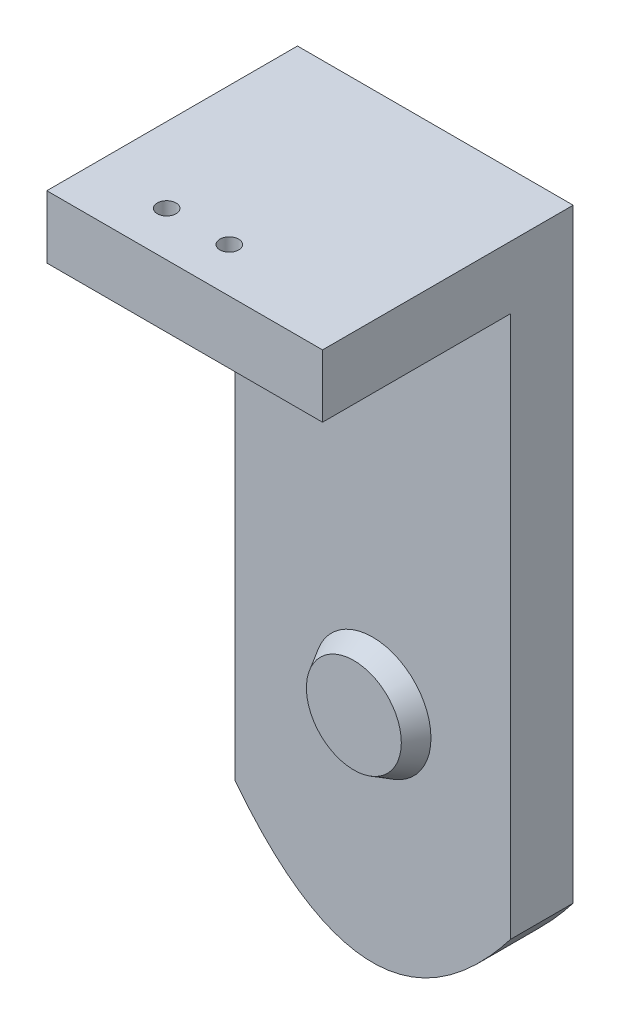
ISO-10303-21;
HEADER;
FILE_DESCRIPTION(('STEP AP214'),'2;1');
FILE_NAME('part.step','',(''),(''),'','','');
FILE_SCHEMA(('AUTOMOTIVE_DESIGN { 1 0 10303 214 1 1 1 1 }'));
ENDSEC;
DATA;
#1=APPLICATION_CONTEXT('core data for automotive mechanical design processes');
#2=APPLICATION_PROTOCOL_DEFINITION('international standard','automotive_design',2000,#1);
#3=PRODUCT_CONTEXT('',#1,'mechanical');
#4=PRODUCT('Part','Part','',(#3));
#5=PRODUCT_RELATED_PRODUCT_CATEGORY('part','',(#4));
#6=PRODUCT_DEFINITION_FORMATION('','',#4);
#7=PRODUCT_DEFINITION_CONTEXT('part definition',#1,'design');
#8=PRODUCT_DEFINITION('design','',#6,#7);
#9=PRODUCT_DEFINITION_SHAPE('','',#8);
#10=(LENGTH_UNIT() NAMED_UNIT(*) SI_UNIT(.MILLI.,.METRE.));
#11=(NAMED_UNIT(*) PLANE_ANGLE_UNIT() SI_UNIT($,.RADIAN.));
#12=(NAMED_UNIT(*) SI_UNIT($,.STERADIAN.) SOLID_ANGLE_UNIT());
#13=UNCERTAINTY_MEASURE_WITH_UNIT(LENGTH_MEASURE(1.E-05),#10,'distance_accuracy_value','');
#14=(GEOMETRIC_REPRESENTATION_CONTEXT(3) GLOBAL_UNCERTAINTY_ASSIGNED_CONTEXT((#13)) GLOBAL_UNIT_ASSIGNED_CONTEXT((#10,
#11,#12)) REPRESENTATION_CONTEXT('',''));
#15=CARTESIAN_POINT('',(0.,0.,0.));
#16=DIRECTION('',(0.,0.,1.));
#17=DIRECTION('',(1.,0.,0.));
#18=AXIS2_PLACEMENT_3D('',#15,#16,#17);
#19=CARTESIAN_POINT('',(0.,-35.6854838709678,10.));
#20=DIRECTION('',(0.,0.,-1.));
#21=DIRECTION('',(-1.,0.,0.));
#22=AXIS2_PLACEMENT_3D('',#19,#20,#21);
#23=PLANE('',#22);
#24=CARTESIAN_POINT('',(0.,0.,10.));
#25=DIRECTION('',(0.,0.,-1.));
#26=DIRECTION('',(-1.,0.,0.));
#27=AXIS2_PLACEMENT_3D('',#24,#25,#26);
#28=CIRCLE('',#27,9.30575593830064);
#29=CARTESIAN_POINT('',(-9.30575593830064,0.,10.));
#30=VERTEX_POINT('',#29);
#31=EDGE_CURVE('E11',#30,#30,#28,.F.);
#32=ORIENTED_EDGE('',*,*,#31,.F.);
#33=EDGE_LOOP('',(#32));
#34=FACE_BOUND('',#33,.T.);
#35=DIRECTION('',(1.,0.,0.));
#36=VECTOR('',#35,1.);
#37=CARTESIAN_POINT('',(-22.,65.,10.));
#38=LINE('',#37,#36);
#39=CARTESIAN_POINT('',(-22.,65.,10.));
#40=VERTEX_POINT('',#39);
#41=CARTESIAN_POINT('',(22.,65.,10.));
#42=VERTEX_POINT('',#41);
#43=EDGE_CURVE('E55',#40,#42,#38,.T.);
#44=ORIENTED_EDGE('',*,*,#43,.F.);
#45=DIRECTION('',(0.,-1.,0.));
#46=VECTOR('',#45,1.);
#47=CARTESIAN_POINT('',(-22.,75.,10.));
#48=LINE('',#47,#46);
#49=CARTESIAN_POINT('',(-22.,-21.4717741935484,10.));
#50=VERTEX_POINT('',#49);
#51=EDGE_CURVE('E109',#40,#50,#48,.T.);
#52=ORIENTED_EDGE('',*,*,#51,.T.);
#53=CARTESIAN_POINT('',(-22.,-21.4717741935484,10.));
#54=CARTESIAN_POINT('',(0.,-49.8991935483871,10.));
#55=CARTESIAN_POINT('',(22.,-21.4717741935484,10.));
#56=B_SPLINE_CURVE_WITH_KNOTS('',2,(#53,#54,#55),.UNSPECIFIED.,.F.,.F.,(3,3),(0.,1.),.UNSPECIFIED.);
#57=CARTESIAN_POINT('',(22.,-21.4717741935484,10.));
#58=VERTEX_POINT('',#57);
#59=EDGE_CURVE('E112',#50,#58,#56,.T.);
#60=ORIENTED_EDGE('',*,*,#59,.T.);
#61=DIRECTION('',(0.,-1.,0.));
#62=VECTOR('',#61,1.);
#63=CARTESIAN_POINT('',(22.,75.,10.));
#64=LINE('',#63,#62);
#65=EDGE_CURVE('E63',#42,#58,#64,.T.);
#66=ORIENTED_EDGE('',*,*,#65,.F.);
#67=EDGE_LOOP('',(#44,#52,#60,#66));
#68=FACE_BOUND('',#67,.T.);
#69=ADVANCED_FACE('F40',(#34,#68),#23,.F.);
#70=CARTESIAN_POINT('',(-22.,75.,10.));
#71=DIRECTION('',(1.,0.,0.));
#72=DIRECTION('',(0.,0.,-1.));
#73=AXIS2_PLACEMENT_3D('',#70,#71,#72);
#74=PLANE('',#73);
#75=DIRECTION('',(0.,-1.,0.));
#76=VECTOR('',#75,1.);
#77=CARTESIAN_POINT('',(-22.,75.,0.));
#78=LINE('',#77,#76);
#79=CARTESIAN_POINT('',(-22.,75.,0.));
#80=VERTEX_POINT('',#79);
#81=CARTESIAN_POINT('',(-22.,-21.4717741935484,0.));
#82=VERTEX_POINT('',#81);
#83=EDGE_CURVE('E86',#80,#82,#78,.T.);
#84=ORIENTED_EDGE('',*,*,#83,.T.);
#85=DIRECTION('',(0.,0.,-1.));
#86=VECTOR('',#85,1.);
#87=CARTESIAN_POINT('',(-22.,-21.4717741935484,10.));
#88=LINE('',#87,#86);
#89=EDGE_CURVE('E48',#50,#82,#88,.T.);
#90=ORIENTED_EDGE('',*,*,#89,.F.);
#91=ORIENTED_EDGE('',*,*,#51,.F.);
#92=DIRECTION('',(0.,0.,-1.));
#93=VECTOR('',#92,1.);
#94=CARTESIAN_POINT('',(-22.,65.,40.));
#95=LINE('',#94,#93);
#96=CARTESIAN_POINT('',(-22.,65.,40.));
#97=VERTEX_POINT('',#96);
#98=EDGE_CURVE('E153',#97,#40,#95,.T.);
#99=ORIENTED_EDGE('',*,*,#98,.F.);
#100=DIRECTION('',(0.,-1.,0.));
#101=VECTOR('',#100,1.);
#102=CARTESIAN_POINT('',(-22.,75.,40.));
#103=LINE('',#102,#101);
#104=CARTESIAN_POINT('',(-22.,75.,40.));
#105=VERTEX_POINT('',#104);
#106=EDGE_CURVE('E89',#105,#97,#103,.T.);
#107=ORIENTED_EDGE('',*,*,#106,.F.);
#108=DIRECTION('',(0.,0.,-1.));
#109=VECTOR('',#108,1.);
#110=CARTESIAN_POINT('',(-22.,75.,10.));
#111=LINE('',#110,#109);
#112=EDGE_CURVE('E82',#105,#80,#111,.T.);
#113=ORIENTED_EDGE('',*,*,#112,.T.);
#114=EDGE_LOOP('',(#84,#90,#91,#99,#107,#113));
#115=FACE_BOUND('',#114,.T.);
#116=ADVANCED_FACE('F84',(#115),#74,.F.);
#117=DIRECTION('',(0.,0.,-1.));
#118=VECTOR('',#117,1.);
#119=SURFACE_OF_LINEAR_EXTRUSION('',#56,#118);
#120=CARTESIAN_POINT('',(-22.,-21.4717741935484,0.));
#121=CARTESIAN_POINT('',(0.,-49.8991935483871,0.));
#122=CARTESIAN_POINT('',(22.,-21.4717741935484,0.));
#123=B_SPLINE_CURVE_WITH_KNOTS('',2,(#120,#121,#122),.UNSPECIFIED.,.F.,.F.,(3,3),(0.,1.),.UNSPECIFIED.);
#124=CARTESIAN_POINT('',(22.,-21.4717741935484,0.));
#125=VERTEX_POINT('',#124);
#126=EDGE_CURVE('E102',#82,#125,#123,.T.);
#127=ORIENTED_EDGE('',*,*,#126,.T.);
#128=DIRECTION('',(0.,0.,-1.));
#129=VECTOR('',#128,1.);
#130=CARTESIAN_POINT('',(22.,-21.4717741935484,10.));
#131=LINE('',#130,#129);
#132=EDGE_CURVE('E118',#58,#125,#131,.T.);
#133=ORIENTED_EDGE('',*,*,#132,.F.);
#134=ORIENTED_EDGE('',*,*,#59,.F.);
#135=ORIENTED_EDGE('',*,*,#89,.T.);
#136=EDGE_LOOP('',(#127,#133,#134,#135));
#137=FACE_BOUND('',#136,.T.);
#138=ADVANCED_FACE('F166',(#137),#119,.F.);
#139=CARTESIAN_POINT('',(22.,75.,10.));
#140=DIRECTION('',(1.,0.,0.));
#141=DIRECTION('',(0.,0.,-1.));
#142=AXIS2_PLACEMENT_3D('',#139,#140,#141);
#143=PLANE('',#142);
#144=DIRECTION('',(0.,-1.,0.));
#145=VECTOR('',#144,1.);
#146=CARTESIAN_POINT('',(22.,75.,0.));
#147=LINE('',#146,#145);
#148=CARTESIAN_POINT('',(22.,75.,0.));
#149=VERTEX_POINT('',#148);
#150=EDGE_CURVE('E110',#149,#125,#147,.T.);
#151=ORIENTED_EDGE('',*,*,#150,.F.);
#152=DIRECTION('',(0.,0.,-1.));
#153=VECTOR('',#152,1.);
#154=CARTESIAN_POINT('',(22.,75.,10.));
#155=LINE('',#154,#153);
#156=CARTESIAN_POINT('',(22.,75.,40.));
#157=VERTEX_POINT('',#156);
#158=EDGE_CURVE('E94',#157,#149,#155,.T.);
#159=ORIENTED_EDGE('',*,*,#158,.F.);
#160=DIRECTION('',(0.,-1.,0.));
#161=VECTOR('',#160,1.);
#162=CARTESIAN_POINT('',(22.,75.,40.));
#163=LINE('',#162,#161);
#164=CARTESIAN_POINT('',(22.,65.,40.));
#165=VERTEX_POINT('',#164);
#166=EDGE_CURVE('E145',#157,#165,#163,.T.);
#167=ORIENTED_EDGE('',*,*,#166,.T.);
#168=DIRECTION('',(0.,0.,-1.));
#169=VECTOR('',#168,1.);
#170=CARTESIAN_POINT('',(22.,65.,40.));
#171=LINE('',#170,#169);
#172=EDGE_CURVE('E150',#165,#42,#171,.T.);
#173=ORIENTED_EDGE('',*,*,#172,.T.);
#174=ORIENTED_EDGE('',*,*,#65,.T.);
#175=ORIENTED_EDGE('',*,*,#132,.T.);
#176=EDGE_LOOP('',(#151,#159,#167,#173,#174,#175));
#177=FACE_BOUND('',#176,.T.);
#178=ADVANCED_FACE('F169',(#177),#143,.T.);
#179=CARTESIAN_POINT('',(-22.,75.,10.));
#180=DIRECTION('',(0.,1.,0.));
#181=DIRECTION('',(-1.,0.,0.));
#182=AXIS2_PLACEMENT_3D('',#179,#180,#181);
#183=PLANE('',#182);
#184=CARTESIAN_POINT('',(-10.,75.,32.875114596426));
#185=DIRECTION('',(0.,1.,0.));
#186=DIRECTION('',(-1.,0.,0.));
#187=AXIS2_PLACEMENT_3D('',#184,#185,#186);
#188=CIRCLE('',#187,1.5);
#189=CARTESIAN_POINT('',(-11.5,75.,32.875114596426));
#190=VERTEX_POINT('',#189);
#191=EDGE_CURVE('E126',#190,#190,#188,.T.);
#192=ORIENTED_EDGE('',*,*,#191,.F.);
#193=EDGE_LOOP('',(#192));
#194=FACE_BOUND('',#193,.T.);
#195=CARTESIAN_POINT('',(0.,75.,32.875114596426));
#196=DIRECTION('',(0.,1.,0.));
#197=DIRECTION('',(-1.,0.,0.));
#198=AXIS2_PLACEMENT_3D('',#195,#196,#197);
#199=CIRCLE('',#198,1.5);
#200=CARTESIAN_POINT('',(-1.50000000000002,75.,32.875114596426));
#201=VERTEX_POINT('',#200);
#202=EDGE_CURVE('E123',#201,#201,#199,.T.);
#203=ORIENTED_EDGE('',*,*,#202,.F.);
#204=EDGE_LOOP('',(#203));
#205=FACE_BOUND('',#204,.T.);
#206=DIRECTION('',(1.,0.,0.));
#207=VECTOR('',#206,1.);
#208=CARTESIAN_POINT('',(-22.,75.,0.));
#209=LINE('',#208,#207);
#210=EDGE_CURVE('E100',#80,#149,#209,.T.);
#211=ORIENTED_EDGE('',*,*,#210,.F.);
#212=ORIENTED_EDGE('',*,*,#112,.F.);
#213=DIRECTION('',(1.,0.,0.));
#214=VECTOR('',#213,1.);
#215=CARTESIAN_POINT('',(-22.,75.,40.));
#216=LINE('',#215,#214);
#217=EDGE_CURVE('E148',#105,#157,#216,.T.);
#218=ORIENTED_EDGE('',*,*,#217,.T.);
#219=ORIENTED_EDGE('',*,*,#158,.T.);
#220=EDGE_LOOP('',(#211,#212,#218,#219));
#221=FACE_BOUND('',#220,.T.);
#222=ADVANCED_FACE('F106',(#194,#205,#221),#183,.T.);
#223=CARTESIAN_POINT('',(0.,-35.6854838709678,0.));
#224=DIRECTION('',(0.,0.,-1.));
#225=DIRECTION('',(-1.,0.,0.));
#226=AXIS2_PLACEMENT_3D('',#223,#224,#225);
#227=PLANE('',#226);
#228=CARTESIAN_POINT('',(0.,0.,0.));
#229=DIRECTION('',(0.,0.,1.));
#230=DIRECTION('',(1.,0.,0.));
#231=AXIS2_PLACEMENT_3D('',#228,#229,#230);
#232=CIRCLE('',#231,6.);
#233=CARTESIAN_POINT('',(6.,0.,0.));
#234=VERTEX_POINT('',#233);
#235=EDGE_CURVE('E104',#234,#234,#232,.T.);
#236=ORIENTED_EDGE('',*,*,#235,.T.);
#237=EDGE_LOOP('',(#236));
#238=FACE_BOUND('',#237,.T.);
#239=ORIENTED_EDGE('',*,*,#83,.F.);
#240=ORIENTED_EDGE('',*,*,#210,.T.);
#241=ORIENTED_EDGE('',*,*,#150,.T.);
#242=ORIENTED_EDGE('',*,*,#126,.F.);
#243=EDGE_LOOP('',(#239,#240,#241,#242));
#244=FACE_BOUND('',#243,.T.);
#245=ADVANCED_FACE('F98',(#238,#244),#227,.T.);
#246=CARTESIAN_POINT('',(0.,0.,23.));
#247=DIRECTION('',(0.,0.,-1.));
#248=DIRECTION('',(-1.,0.,0.));
#249=AXIS2_PLACEMENT_3D('',#246,#247,#248);
#250=CYLINDRICAL_SURFACE('',#249,6.);
#251=ORIENTED_EDGE('',*,*,#235,.F.);
#252=EDGE_LOOP('',(#251));
#253=FACE_BOUND('',#252,.T.);
#254=CARTESIAN_POINT('',(0.,0.,10.));
#255=DIRECTION('',(0.,0.,1.));
#256=DIRECTION('',(1.,0.,0.));
#257=AXIS2_PLACEMENT_3D('',#254,#255,#256);
#258=CIRCLE('',#257,6.);
#259=CARTESIAN_POINT('',(6.,0.,10.));
#260=VERTEX_POINT('',#259);
#261=EDGE_CURVE('E132',#260,#260,#258,.T.);
#262=ORIENTED_EDGE('',*,*,#261,.T.);
#263=EDGE_LOOP('',(#262));
#264=FACE_BOUND('',#263,.T.);
#265=ADVANCED_FACE('F183',(#253,#264),#250,.F.);
#266=CARTESIAN_POINT('',(-22.,65.,40.));
#267=DIRECTION('',(0.,1.,0.));
#268=DIRECTION('',(0.,0.,1.));
#269=AXIS2_PLACEMENT_3D('',#266,#267,#268);
#270=PLANE('',#269);
#271=CARTESIAN_POINT('',(-10.,65.,32.875114596426));
#272=DIRECTION('',(0.,1.,0.));
#273=DIRECTION('',(0.,0.,1.));
#274=AXIS2_PLACEMENT_3D('',#271,#272,#273);
#275=CIRCLE('',#274,1.5);
#276=CARTESIAN_POINT('',(-10.,65.,34.375114596426));
#277=VERTEX_POINT('',#276);
#278=EDGE_CURVE('E124',#277,#277,#275,.T.);
#279=ORIENTED_EDGE('',*,*,#278,.T.);
#280=EDGE_LOOP('',(#279));
#281=FACE_BOUND('',#280,.T.);
#282=CARTESIAN_POINT('',(0.,65.,32.875114596426));
#283=DIRECTION('',(0.,1.,0.));
#284=DIRECTION('',(0.,0.,1.));
#285=AXIS2_PLACEMENT_3D('',#282,#283,#284);
#286=CIRCLE('',#285,1.5);
#287=CARTESIAN_POINT('',(0.,65.,34.375114596426));
#288=VERTEX_POINT('',#287);
#289=EDGE_CURVE('E121',#288,#288,#286,.T.);
#290=ORIENTED_EDGE('',*,*,#289,.T.);
#291=EDGE_LOOP('',(#290));
#292=FACE_BOUND('',#291,.T.);
#293=ORIENTED_EDGE('',*,*,#43,.T.);
#294=ORIENTED_EDGE('',*,*,#172,.F.);
#295=DIRECTION('',(1.,0.,0.));
#296=VECTOR('',#295,1.);
#297=CARTESIAN_POINT('',(-22.,65.,40.));
#298=LINE('',#297,#296);
#299=EDGE_CURVE('E142',#97,#165,#298,.T.);
#300=ORIENTED_EDGE('',*,*,#299,.F.);
#301=ORIENTED_EDGE('',*,*,#98,.T.);
#302=EDGE_LOOP('',(#293,#294,#300,#301));
#303=FACE_BOUND('',#302,.T.);
#304=ADVANCED_FACE('F203',(#281,#292,#303),#270,.F.);
#305=CARTESIAN_POINT('',(0.,0.,40.));
#306=DIRECTION('',(0.,0.,1.));
#307=DIRECTION('',(1.,0.,0.));
#308=AXIS2_PLACEMENT_3D('',#305,#306,#307);
#309=PLANE('',#308);
#310=ORIENTED_EDGE('',*,*,#106,.T.);
#311=ORIENTED_EDGE('',*,*,#299,.T.);
#312=ORIENTED_EDGE('',*,*,#166,.F.);
#313=ORIENTED_EDGE('',*,*,#217,.F.);
#314=EDGE_LOOP('',(#310,#311,#312,#313));
#315=FACE_BOUND('',#314,.T.);
#316=ADVANCED_FACE('F199',(#315),#309,.T.);
#317=CARTESIAN_POINT('',(0.,60.,32.875114596426));
#318=DIRECTION('',(0.,1.,0.));
#319=DIRECTION('',(-1.,0.,0.));
#320=AXIS2_PLACEMENT_3D('',#317,#318,#319);
#321=CYLINDRICAL_SURFACE('',#320,1.5);
#322=ORIENTED_EDGE('',*,*,#202,.T.);
#323=EDGE_LOOP('',(#322));
#324=FACE_BOUND('',#323,.T.);
#325=ORIENTED_EDGE('',*,*,#289,.F.);
#326=EDGE_LOOP('',(#325));
#327=FACE_BOUND('',#326,.T.);
#328=ADVANCED_FACE('F195',(#324,#327),#321,.F.);
#329=CARTESIAN_POINT('',(-10.,60.,32.875114596426));
#330=DIRECTION('',(0.,1.,0.));
#331=DIRECTION('',(-1.,0.,0.));
#332=AXIS2_PLACEMENT_3D('',#329,#330,#331);
#333=CYLINDRICAL_SURFACE('',#332,1.5);
#334=ORIENTED_EDGE('',*,*,#191,.T.);
#335=EDGE_LOOP('',(#334));
#336=FACE_BOUND('',#335,.T.);
#337=ORIENTED_EDGE('',*,*,#278,.F.);
#338=EDGE_LOOP('',(#337));
#339=FACE_BOUND('',#338,.T.);
#340=ADVANCED_FACE('F198',(#336,#339),#333,.F.);
#341=CARTESIAN_POINT('',(0.,0.,10.));
#342=DIRECTION('',(0.,0.,1.));
#343=DIRECTION('',(1.,0.,0.));
#344=AXIS2_PLACEMENT_3D('',#341,#342,#343);
#345=PLANE('',#344);
#346=ORIENTED_EDGE('',*,*,#261,.F.);
#347=EDGE_LOOP('',(#346));
#348=FACE_BOUND('',#347,.T.);
#349=ADVANCED_FACE('F232',(#348),#345,.F.);
#350=CARTESIAN_POINT('',(0.,0.,13.));
#351=DIRECTION('',(0.,0.,-1.));
#352=DIRECTION('',(1.,0.,0.));
#353=AXIS2_PLACEMENT_3D('',#350,#351,#352);
#354=CONICAL_SURFACE('',#353,7.57370513073176,0.5235987755983);
#355=CARTESIAN_POINT('',(0.,0.,13.));
#356=DIRECTION('',(0.,0.,1.));
#357=DIRECTION('',(1.,0.,0.));
#358=AXIS2_PLACEMENT_3D('',#355,#356,#357);
#359=CIRCLE('',#358,7.57370513073176);
#360=CARTESIAN_POINT('',(7.57370513073176,0.,13.));
#361=VERTEX_POINT('',#360);
#362=EDGE_CURVE('E137',#361,#361,#359,.T.);
#363=ORIENTED_EDGE('',*,*,#362,.F.);
#364=EDGE_LOOP('',(#363));
#365=FACE_BOUND('',#364,.T.);
#366=ORIENTED_EDGE('',*,*,#31,.T.);
#367=EDGE_LOOP('',(#366));
#368=FACE_BOUND('',#367,.T.);
#369=ADVANCED_FACE('F42',(#365,#368),#354,.T.);
#370=CARTESIAN_POINT('',(0.,0.,13.));
#371=DIRECTION('',(0.,0.,1.));
#372=DIRECTION('',(1.,0.,0.));
#373=AXIS2_PLACEMENT_3D('',#370,#371,#372);
#374=PLANE('',#373);
#375=ORIENTED_EDGE('',*,*,#362,.T.);
#376=EDGE_LOOP('',(#375));
#377=FACE_BOUND('',#376,.T.);
#378=ADVANCED_FACE('F236',(#377),#374,.T.);
#379=CLOSED_SHELL('',(#69,#116,#138,#178,#222,#245,#265,#304,#316,#328,#340,#349,#369,#378));
#380=MANIFOLD_SOLID_BREP('B2',#379);
#381=ADVANCED_BREP_SHAPE_REPRESENTATION('',(#18,#380),#14);
#382=SHAPE_DEFINITION_REPRESENTATION(#9,#381);
ENDSEC;
END-ISO-10303-21;
